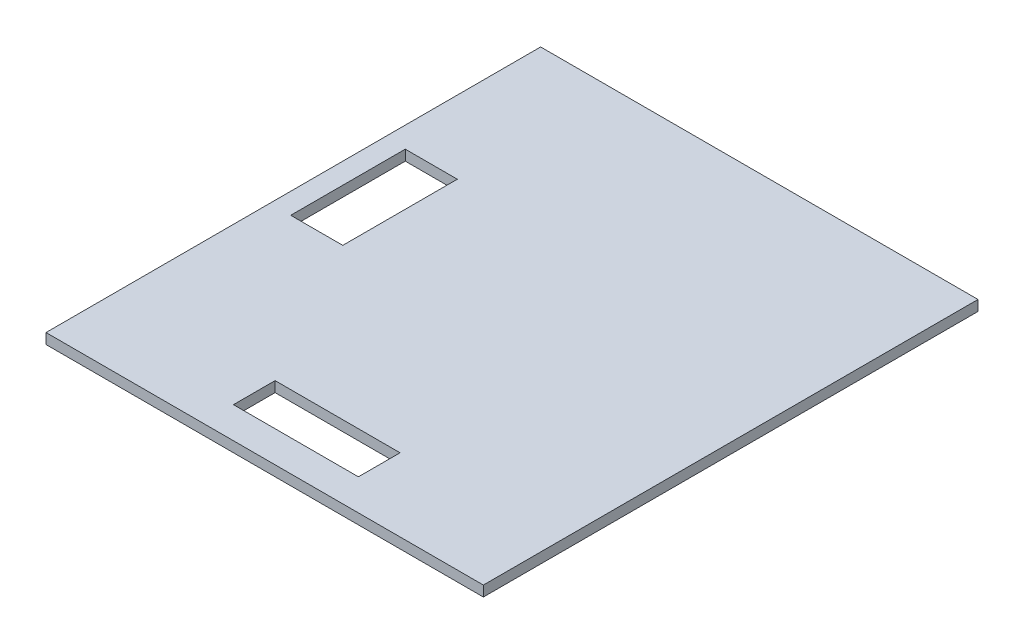
ISO-10303-21;
HEADER;
FILE_DESCRIPTION(('STEP AP214'),'2;1');
FILE_NAME('part.step','',(''),(''),'','','');
FILE_SCHEMA(('AUTOMOTIVE_DESIGN { 1 0 10303 214 1 1 1 1 }'));
ENDSEC;
DATA;
#1=APPLICATION_CONTEXT('core data for automotive mechanical design processes');
#2=APPLICATION_PROTOCOL_DEFINITION('international standard','automotive_design',2000,#1);
#3=PRODUCT_CONTEXT('',#1,'mechanical');
#4=PRODUCT('Part','Part','',(#3));
#5=PRODUCT_RELATED_PRODUCT_CATEGORY('part','',(#4));
#6=PRODUCT_DEFINITION_FORMATION('','',#4);
#7=PRODUCT_DEFINITION_CONTEXT('part definition',#1,'design');
#8=PRODUCT_DEFINITION('design','',#6,#7);
#9=PRODUCT_DEFINITION_SHAPE('','',#8);
#10=(LENGTH_UNIT() NAMED_UNIT(*) SI_UNIT(.MILLI.,.METRE.));
#11=(NAMED_UNIT(*) PLANE_ANGLE_UNIT() SI_UNIT($,.RADIAN.));
#12=(NAMED_UNIT(*) SI_UNIT($,.STERADIAN.) SOLID_ANGLE_UNIT());
#13=UNCERTAINTY_MEASURE_WITH_UNIT(LENGTH_MEASURE(1.E-05),#10,'distance_accuracy_value','');
#14=(GEOMETRIC_REPRESENTATION_CONTEXT(3) GLOBAL_UNCERTAINTY_ASSIGNED_CONTEXT((#13)) GLOBAL_UNIT_ASSIGNED_CONTEXT((#10,
#11,#12)) REPRESENTATION_CONTEXT('',''));
#15=CARTESIAN_POINT('',(0.,0.,0.));
#16=DIRECTION('',(0.,0.,1.));
#17=DIRECTION('',(1.,0.,0.));
#18=AXIS2_PLACEMENT_3D('',#15,#16,#17);
#19=CARTESIAN_POINT('',(0.,1.,0.));
#20=DIRECTION('',(0.,-1.,0.));
#21=DIRECTION('',(0.,0.,-1.));
#22=AXIS2_PLACEMENT_3D('',#19,#20,#21);
#23=PLANE('',#22);
#24=DIRECTION('',(0.,0.,1.));
#25=VECTOR('',#24,1.);
#26=CARTESIAN_POINT('',(-6.00000000000001,1.,0.));
#27=LINE('',#26,#25);
#28=CARTESIAN_POINT('',(-6.00000000000001,1.,16.75));
#29=VERTEX_POINT('',#28);
#30=CARTESIAN_POINT('',(-6.00000000000001,1.,20.75));
#31=VERTEX_POINT('',#30);
#32=EDGE_CURVE('E183',#29,#31,#27,.T.);
#33=ORIENTED_EDGE('',*,*,#32,.F.);
#34=DIRECTION('',(-1.,0.,0.));
#35=VECTOR('',#34,1.);
#36=CARTESIAN_POINT('',(0.,1.,16.75));
#37=LINE('',#36,#35);
#38=CARTESIAN_POINT('',(6.,1.,16.75));
#39=VERTEX_POINT('',#38);
#40=EDGE_CURVE('E135',#39,#29,#37,.T.);
#41=ORIENTED_EDGE('',*,*,#40,.F.);
#42=DIRECTION('',(0.,0.,-1.));
#43=VECTOR('',#42,1.);
#44=CARTESIAN_POINT('',(6.,1.,0.));
#45=LINE('',#44,#43);
#46=CARTESIAN_POINT('',(6.,1.,20.75));
#47=VERTEX_POINT('',#46);
#48=EDGE_CURVE('E179',#47,#39,#45,.T.);
#49=ORIENTED_EDGE('',*,*,#48,.F.);
#50=DIRECTION('',(1.,0.,0.));
#51=VECTOR('',#50,1.);
#52=CARTESIAN_POINT('',(0.,1.,20.75));
#53=LINE('',#52,#51);
#54=EDGE_CURVE('E181',#31,#47,#53,.T.);
#55=ORIENTED_EDGE('',*,*,#54,.F.);
#56=EDGE_LOOP('',(#33,#41,#49,#55));
#57=FACE_BOUND('',#56,.T.);
#58=DIRECTION('',(0.,0.,-1.));
#59=VECTOR('',#58,1.);
#60=CARTESIAN_POINT('',(21.,1.,23.75));
#61=LINE('',#60,#59);
#62=CARTESIAN_POINT('',(21.,1.,23.75));
#63=VERTEX_POINT('',#62);
#64=CARTESIAN_POINT('',(21.,1.,-23.75));
#65=VERTEX_POINT('',#64);
#66=EDGE_CURVE('E193',#63,#65,#61,.T.);
#67=ORIENTED_EDGE('',*,*,#66,.T.);
#68=DIRECTION('',(-1.,0.,0.));
#69=VECTOR('',#68,1.);
#70=CARTESIAN_POINT('',(-21.,1.,-23.75));
#71=LINE('',#70,#69);
#72=CARTESIAN_POINT('',(-21.,1.,-23.75));
#73=VERTEX_POINT('',#72);
#74=EDGE_CURVE('E196',#65,#73,#71,.T.);
#75=ORIENTED_EDGE('',*,*,#74,.T.);
#76=DIRECTION('',(0.,0.,1.));
#77=VECTOR('',#76,1.);
#78=CARTESIAN_POINT('',(-21.,1.,23.75));
#79=LINE('',#78,#77);
#80=CARTESIAN_POINT('',(-21.,1.,23.75));
#81=VERTEX_POINT('',#80);
#82=EDGE_CURVE('E199',#73,#81,#79,.T.);
#83=ORIENTED_EDGE('',*,*,#82,.T.);
#84=DIRECTION('',(1.,0.,0.));
#85=VECTOR('',#84,1.);
#86=CARTESIAN_POINT('',(-21.,1.,23.75));
#87=LINE('',#86,#85);
#88=EDGE_CURVE('E201',#81,#63,#87,.T.);
#89=ORIENTED_EDGE('',*,*,#88,.T.);
#90=EDGE_LOOP('',(#67,#75,#83,#89));
#91=FACE_BOUND('',#90,.T.);
#92=DIRECTION('',(0.,0.,1.));
#93=VECTOR('',#92,1.);
#94=CARTESIAN_POINT('',(-19.,1.,0.));
#95=LINE('',#94,#93);
#96=CARTESIAN_POINT('',(-19.,1.,-8.75));
#97=VERTEX_POINT('',#96);
#98=CARTESIAN_POINT('',(-19.,1.,2.25));
#99=VERTEX_POINT('',#98);
#100=EDGE_CURVE('E132',#97,#99,#95,.T.);
#101=ORIENTED_EDGE('',*,*,#100,.F.);
#102=DIRECTION('',(-1.,0.,0.));
#103=VECTOR('',#102,1.);
#104=CARTESIAN_POINT('',(0.,1.,-8.75));
#105=LINE('',#104,#103);
#106=CARTESIAN_POINT('',(-14.,1.,-8.75));
#107=VERTEX_POINT('',#106);
#108=EDGE_CURVE('E185',#107,#97,#105,.T.);
#109=ORIENTED_EDGE('',*,*,#108,.F.);
#110=DIRECTION('',(0.,0.,-1.));
#111=VECTOR('',#110,1.);
#112=CARTESIAN_POINT('',(-14.,1.,0.));
#113=LINE('',#112,#111);
#114=CARTESIAN_POINT('',(-14.,1.,2.25));
#115=VERTEX_POINT('',#114);
#116=EDGE_CURVE('E187',#115,#107,#113,.T.);
#117=ORIENTED_EDGE('',*,*,#116,.F.);
#118=DIRECTION('',(1.,0.,0.));
#119=VECTOR('',#118,1.);
#120=CARTESIAN_POINT('',(0.,1.,2.25));
#121=LINE('',#120,#119);
#122=EDGE_CURVE('E189',#99,#115,#121,.T.);
#123=ORIENTED_EDGE('',*,*,#122,.F.);
#124=EDGE_LOOP('',(#101,#109,#117,#123));
#125=FACE_BOUND('',#124,.T.);
#126=ADVANCED_FACE('F36',(#57,#91,#125),#23,.F.);
#127=CARTESIAN_POINT('',(0.,0.,0.));
#128=DIRECTION('',(0.,-1.,0.));
#129=DIRECTION('',(0.,0.,-1.));
#130=AXIS2_PLACEMENT_3D('',#127,#128,#129);
#131=PLANE('',#130);
#132=DIRECTION('',(0.,0.,-1.));
#133=VECTOR('',#132,1.);
#134=CARTESIAN_POINT('',(21.,0.,23.75));
#135=LINE('',#134,#133);
#136=CARTESIAN_POINT('',(21.,0.,23.75));
#137=VERTEX_POINT('',#136);
#138=CARTESIAN_POINT('',(21.,0.,-23.75));
#139=VERTEX_POINT('',#138);
#140=EDGE_CURVE('E192',#137,#139,#135,.T.);
#141=ORIENTED_EDGE('',*,*,#140,.F.);
#142=DIRECTION('',(1.,0.,0.));
#143=VECTOR('',#142,1.);
#144=CARTESIAN_POINT('',(-21.,0.,23.75));
#145=LINE('',#144,#143);
#146=CARTESIAN_POINT('',(-21.,0.,23.75));
#147=VERTEX_POINT('',#146);
#148=EDGE_CURVE('E197',#147,#137,#145,.T.);
#149=ORIENTED_EDGE('',*,*,#148,.F.);
#150=DIRECTION('',(0.,0.,1.));
#151=VECTOR('',#150,1.);
#152=CARTESIAN_POINT('',(-21.,0.,23.75));
#153=LINE('',#152,#151);
#154=CARTESIAN_POINT('',(-21.,0.,-23.75));
#155=VERTEX_POINT('',#154);
#156=EDGE_CURVE('E208',#155,#147,#153,.T.);
#157=ORIENTED_EDGE('',*,*,#156,.F.);
#158=DIRECTION('',(-1.,0.,0.));
#159=VECTOR('',#158,1.);
#160=CARTESIAN_POINT('',(-21.,0.,-23.75));
#161=LINE('',#160,#159);
#162=EDGE_CURVE('E206',#139,#155,#161,.T.);
#163=ORIENTED_EDGE('',*,*,#162,.F.);
#164=EDGE_LOOP('',(#141,#149,#157,#163));
#165=FACE_BOUND('',#164,.T.);
#166=DIRECTION('',(-1.,0.,0.));
#167=VECTOR('',#166,1.);
#168=CARTESIAN_POINT('',(-6.00000000000001,0.,16.75));
#169=LINE('',#168,#167);
#170=CARTESIAN_POINT('',(6.,0.,16.75));
#171=VERTEX_POINT('',#170);
#172=CARTESIAN_POINT('',(-6.00000000000001,0.,16.75));
#173=VERTEX_POINT('',#172);
#174=EDGE_CURVE('E170',#171,#173,#169,.T.);
#175=ORIENTED_EDGE('',*,*,#174,.T.);
#176=DIRECTION('',(0.,0.,1.));
#177=VECTOR('',#176,1.);
#178=CARTESIAN_POINT('',(-6.00000000000001,0.,20.75));
#179=LINE('',#178,#177);
#180=CARTESIAN_POINT('',(-6.00000000000001,0.,20.75));
#181=VERTEX_POINT('',#180);
#182=EDGE_CURVE('E161',#173,#181,#179,.T.);
#183=ORIENTED_EDGE('',*,*,#182,.T.);
#184=DIRECTION('',(1.,0.,0.));
#185=VECTOR('',#184,1.);
#186=CARTESIAN_POINT('',(-6.00000000000001,0.,20.75));
#187=LINE('',#186,#185);
#188=CARTESIAN_POINT('',(6.,0.,20.75));
#189=VERTEX_POINT('',#188);
#190=EDGE_CURVE('E164',#181,#189,#187,.T.);
#191=ORIENTED_EDGE('',*,*,#190,.T.);
#192=DIRECTION('',(0.,0.,-1.));
#193=VECTOR('',#192,1.);
#194=CARTESIAN_POINT('',(6.,0.,20.75));
#195=LINE('',#194,#193);
#196=EDGE_CURVE('E167',#189,#171,#195,.T.);
#197=ORIENTED_EDGE('',*,*,#196,.T.);
#198=EDGE_LOOP('',(#175,#183,#191,#197));
#199=FACE_BOUND('',#198,.T.);
#200=DIRECTION('',(-1.,0.,0.));
#201=VECTOR('',#200,1.);
#202=CARTESIAN_POINT('',(-19.,0.,-8.75));
#203=LINE('',#202,#201);
#204=CARTESIAN_POINT('',(-14.,0.,-8.75));
#205=VERTEX_POINT('',#204);
#206=CARTESIAN_POINT('',(-19.,0.,-8.75));
#207=VERTEX_POINT('',#206);
#208=EDGE_CURVE('E149',#205,#207,#203,.T.);
#209=ORIENTED_EDGE('',*,*,#208,.T.);
#210=DIRECTION('',(0.,0.,1.));
#211=VECTOR('',#210,1.);
#212=CARTESIAN_POINT('',(-19.,0.,2.25));
#213=LINE('',#212,#211);
#214=CARTESIAN_POINT('',(-19.,0.,2.25));
#215=VERTEX_POINT('',#214);
#216=EDGE_CURVE('E129',#207,#215,#213,.T.);
#217=ORIENTED_EDGE('',*,*,#216,.T.);
#218=DIRECTION('',(1.,0.,0.));
#219=VECTOR('',#218,1.);
#220=CARTESIAN_POINT('',(-19.,0.,2.25));
#221=LINE('',#220,#219);
#222=CARTESIAN_POINT('',(-14.,0.,2.25));
#223=VERTEX_POINT('',#222);
#224=EDGE_CURVE('E139',#215,#223,#221,.T.);
#225=ORIENTED_EDGE('',*,*,#224,.T.);
#226=DIRECTION('',(0.,0.,-1.));
#227=VECTOR('',#226,1.);
#228=CARTESIAN_POINT('',(-14.,0.,2.25));
#229=LINE('',#228,#227);
#230=EDGE_CURVE('E145',#223,#205,#229,.T.);
#231=ORIENTED_EDGE('',*,*,#230,.T.);
#232=EDGE_LOOP('',(#209,#217,#225,#231));
#233=FACE_BOUND('',#232,.T.);
#234=ADVANCED_FACE('F148',(#165,#199,#233),#131,.T.);
#235=CARTESIAN_POINT('',(21.,1.,23.75));
#236=DIRECTION('',(-1.,0.,0.));
#237=DIRECTION('',(0.,0.,1.));
#238=AXIS2_PLACEMENT_3D('',#235,#236,#237);
#239=PLANE('',#238);
#240=ORIENTED_EDGE('',*,*,#140,.T.);
#241=DIRECTION('',(0.,-1.,0.));
#242=VECTOR('',#241,1.);
#243=CARTESIAN_POINT('',(21.,1.,-23.75));
#244=LINE('',#243,#242);
#245=EDGE_CURVE('E11',#65,#139,#244,.T.);
#246=ORIENTED_EDGE('',*,*,#245,.F.);
#247=ORIENTED_EDGE('',*,*,#66,.F.);
#248=DIRECTION('',(0.,-1.,0.));
#249=VECTOR('',#248,1.);
#250=CARTESIAN_POINT('',(21.,1.,23.75));
#251=LINE('',#250,#249);
#252=EDGE_CURVE('E203',#63,#137,#251,.T.);
#253=ORIENTED_EDGE('',*,*,#252,.T.);
#254=EDGE_LOOP('',(#240,#246,#247,#253));
#255=FACE_BOUND('',#254,.T.);
#256=ADVANCED_FACE('F38',(#255),#239,.F.);
#257=CARTESIAN_POINT('',(-21.,1.,-23.75));
#258=DIRECTION('',(0.,0.,1.));
#259=DIRECTION('',(1.,0.,0.));
#260=AXIS2_PLACEMENT_3D('',#257,#258,#259);
#261=PLANE('',#260);
#262=ORIENTED_EDGE('',*,*,#162,.T.);
#263=DIRECTION('',(0.,-1.,0.));
#264=VECTOR('',#263,1.);
#265=CARTESIAN_POINT('',(-21.,1.,-23.75));
#266=LINE('',#265,#264);
#267=EDGE_CURVE('E44',#73,#155,#266,.T.);
#268=ORIENTED_EDGE('',*,*,#267,.F.);
#269=ORIENTED_EDGE('',*,*,#74,.F.);
#270=ORIENTED_EDGE('',*,*,#245,.T.);
#271=EDGE_LOOP('',(#262,#268,#269,#270));
#272=FACE_BOUND('',#271,.T.);
#273=ADVANCED_FACE('F236',(#272),#261,.F.);
#274=CARTESIAN_POINT('',(-21.,1.,23.75));
#275=DIRECTION('',(1.,0.,0.));
#276=DIRECTION('',(0.,0.,-1.));
#277=AXIS2_PLACEMENT_3D('',#274,#275,#276);
#278=PLANE('',#277);
#279=ORIENTED_EDGE('',*,*,#156,.T.);
#280=DIRECTION('',(0.,-1.,0.));
#281=VECTOR('',#280,1.);
#282=CARTESIAN_POINT('',(-21.,1.,23.75));
#283=LINE('',#282,#281);
#284=EDGE_CURVE('E213',#81,#147,#283,.T.);
#285=ORIENTED_EDGE('',*,*,#284,.F.);
#286=ORIENTED_EDGE('',*,*,#82,.F.);
#287=ORIENTED_EDGE('',*,*,#267,.T.);
#288=EDGE_LOOP('',(#279,#285,#286,#287));
#289=FACE_BOUND('',#288,.T.);
#290=ADVANCED_FACE('F220',(#289),#278,.F.);
#291=CARTESIAN_POINT('',(-21.,1.,23.75));
#292=DIRECTION('',(0.,0.,-1.));
#293=DIRECTION('',(-1.,0.,0.));
#294=AXIS2_PLACEMENT_3D('',#291,#292,#293);
#295=PLANE('',#294);
#296=ORIENTED_EDGE('',*,*,#148,.T.);
#297=ORIENTED_EDGE('',*,*,#252,.F.);
#298=ORIENTED_EDGE('',*,*,#88,.F.);
#299=ORIENTED_EDGE('',*,*,#284,.T.);
#300=EDGE_LOOP('',(#296,#297,#298,#299));
#301=FACE_BOUND('',#300,.T.);
#302=ADVANCED_FACE('F229',(#301),#295,.F.);
#303=CARTESIAN_POINT('',(-6.00000000000001,5.,20.75));
#304=DIRECTION('',(1.,0.,0.));
#305=DIRECTION('',(0.,0.,-1.));
#306=AXIS2_PLACEMENT_3D('',#303,#304,#305);
#307=PLANE('',#306);
#308=ORIENTED_EDGE('',*,*,#32,.T.);
#309=DIRECTION('',(0.,-1.,0.));
#310=VECTOR('',#309,1.);
#311=CARTESIAN_POINT('',(-6.00000000000001,5.,20.75));
#312=LINE('',#311,#310);
#313=EDGE_CURVE('E150',#31,#181,#312,.T.);
#314=ORIENTED_EDGE('',*,*,#313,.T.);
#315=ORIENTED_EDGE('',*,*,#182,.F.);
#316=DIRECTION('',(0.,-1.,0.));
#317=VECTOR('',#316,1.);
#318=CARTESIAN_POINT('',(-6.00000000000001,5.,16.75));
#319=LINE('',#318,#317);
#320=EDGE_CURVE('E173',#29,#173,#319,.T.);
#321=ORIENTED_EDGE('',*,*,#320,.F.);
#322=EDGE_LOOP('',(#308,#314,#315,#321));
#323=FACE_BOUND('',#322,.T.);
#324=ADVANCED_FACE('F252',(#323),#307,.T.);
#325=CARTESIAN_POINT('',(-6.00000000000001,5.,20.75));
#326=DIRECTION('',(0.,0.,-1.));
#327=DIRECTION('',(-1.,0.,0.));
#328=AXIS2_PLACEMENT_3D('',#325,#326,#327);
#329=PLANE('',#328);
#330=ORIENTED_EDGE('',*,*,#54,.T.);
#331=DIRECTION('',(0.,-1.,0.));
#332=VECTOR('',#331,1.);
#333=CARTESIAN_POINT('',(6.,5.,20.75));
#334=LINE('',#333,#332);
#335=EDGE_CURVE('E152',#47,#189,#334,.T.);
#336=ORIENTED_EDGE('',*,*,#335,.T.);
#337=ORIENTED_EDGE('',*,*,#190,.F.);
#338=ORIENTED_EDGE('',*,*,#313,.F.);
#339=EDGE_LOOP('',(#330,#336,#337,#338));
#340=FACE_BOUND('',#339,.T.);
#341=ADVANCED_FACE('F259',(#340),#329,.T.);
#342=CARTESIAN_POINT('',(6.,5.,20.75));
#343=DIRECTION('',(-1.,0.,0.));
#344=DIRECTION('',(0.,0.,1.));
#345=AXIS2_PLACEMENT_3D('',#342,#343,#344);
#346=PLANE('',#345);
#347=ORIENTED_EDGE('',*,*,#48,.T.);
#348=DIRECTION('',(0.,-1.,0.));
#349=VECTOR('',#348,1.);
#350=CARTESIAN_POINT('',(6.,5.,16.75));
#351=LINE('',#350,#349);
#352=EDGE_CURVE('E59',#39,#171,#351,.T.);
#353=ORIENTED_EDGE('',*,*,#352,.T.);
#354=ORIENTED_EDGE('',*,*,#196,.F.);
#355=ORIENTED_EDGE('',*,*,#335,.F.);
#356=EDGE_LOOP('',(#347,#353,#354,#355));
#357=FACE_BOUND('',#356,.T.);
#358=ADVANCED_FACE('F264',(#357),#346,.T.);
#359=CARTESIAN_POINT('',(-6.00000000000001,5.,16.75));
#360=DIRECTION('',(0.,0.,1.));
#361=DIRECTION('',(1.,0.,0.));
#362=AXIS2_PLACEMENT_3D('',#359,#360,#361);
#363=PLANE('',#362);
#364=ORIENTED_EDGE('',*,*,#40,.T.);
#365=ORIENTED_EDGE('',*,*,#320,.T.);
#366=ORIENTED_EDGE('',*,*,#174,.F.);
#367=ORIENTED_EDGE('',*,*,#352,.F.);
#368=EDGE_LOOP('',(#364,#365,#366,#367));
#369=FACE_BOUND('',#368,.T.);
#370=ADVANCED_FACE('F275',(#369),#363,.T.);
#371=CARTESIAN_POINT('',(-19.,5.,2.25));
#372=DIRECTION('',(1.,0.,0.));
#373=DIRECTION('',(0.,0.,-1.));
#374=AXIS2_PLACEMENT_3D('',#371,#372,#373);
#375=PLANE('',#374);
#376=ORIENTED_EDGE('',*,*,#100,.T.);
#377=DIRECTION('',(0.,-1.,0.));
#378=VECTOR('',#377,1.);
#379=CARTESIAN_POINT('',(-19.,5.,2.25));
#380=LINE('',#379,#378);
#381=EDGE_CURVE('E124',#99,#215,#380,.T.);
#382=ORIENTED_EDGE('',*,*,#381,.T.);
#383=ORIENTED_EDGE('',*,*,#216,.F.);
#384=DIRECTION('',(0.,-1.,0.));
#385=VECTOR('',#384,1.);
#386=CARTESIAN_POINT('',(-19.,5.,-8.75));
#387=LINE('',#386,#385);
#388=EDGE_CURVE('E157',#97,#207,#387,.T.);
#389=ORIENTED_EDGE('',*,*,#388,.F.);
#390=EDGE_LOOP('',(#376,#382,#383,#389));
#391=FACE_BOUND('',#390,.T.);
#392=ADVANCED_FACE('F126',(#391),#375,.T.);
#393=CARTESIAN_POINT('',(-19.,5.,2.25));
#394=DIRECTION('',(0.,0.,-1.));
#395=DIRECTION('',(-1.,0.,0.));
#396=AXIS2_PLACEMENT_3D('',#393,#394,#395);
#397=PLANE('',#396);
#398=ORIENTED_EDGE('',*,*,#122,.T.);
#399=DIRECTION('',(0.,-1.,0.));
#400=VECTOR('',#399,1.);
#401=CARTESIAN_POINT('',(-14.,5.,2.25));
#402=LINE('',#401,#400);
#403=EDGE_CURVE('E136',#115,#223,#402,.T.);
#404=ORIENTED_EDGE('',*,*,#403,.T.);
#405=ORIENTED_EDGE('',*,*,#224,.F.);
#406=ORIENTED_EDGE('',*,*,#381,.F.);
#407=EDGE_LOOP('',(#398,#404,#405,#406));
#408=FACE_BOUND('',#407,.T.);
#409=ADVANCED_FACE('F140',(#408),#397,.T.);
#410=CARTESIAN_POINT('',(-14.,5.,2.25));
#411=DIRECTION('',(-1.,0.,0.));
#412=DIRECTION('',(0.,0.,1.));
#413=AXIS2_PLACEMENT_3D('',#410,#411,#412);
#414=PLANE('',#413);
#415=ORIENTED_EDGE('',*,*,#116,.T.);
#416=DIRECTION('',(0.,-1.,0.));
#417=VECTOR('',#416,1.);
#418=CARTESIAN_POINT('',(-14.,5.,-8.75));
#419=LINE('',#418,#417);
#420=EDGE_CURVE('E51',#107,#205,#419,.T.);
#421=ORIENTED_EDGE('',*,*,#420,.T.);
#422=ORIENTED_EDGE('',*,*,#230,.F.);
#423=ORIENTED_EDGE('',*,*,#403,.F.);
#424=EDGE_LOOP('',(#415,#421,#422,#423));
#425=FACE_BOUND('',#424,.T.);
#426=ADVANCED_FACE('F287',(#425),#414,.T.);
#427=CARTESIAN_POINT('',(-19.,5.,-8.75));
#428=DIRECTION('',(0.,0.,1.));
#429=DIRECTION('',(1.,0.,0.));
#430=AXIS2_PLACEMENT_3D('',#427,#428,#429);
#431=PLANE('',#430);
#432=ORIENTED_EDGE('',*,*,#108,.T.);
#433=ORIENTED_EDGE('',*,*,#388,.T.);
#434=ORIENTED_EDGE('',*,*,#208,.F.);
#435=ORIENTED_EDGE('',*,*,#420,.F.);
#436=EDGE_LOOP('',(#432,#433,#434,#435));
#437=FACE_BOUND('',#436,.T.);
#438=ADVANCED_FACE('F290',(#437),#431,.T.);
#439=CLOSED_SHELL('',(#126,#234,#256,#273,#290,#302,#324,#341,#358,#370,#392,#409,#426,#438));
#440=MANIFOLD_SOLID_BREP('B2',#439);
#441=ADVANCED_BREP_SHAPE_REPRESENTATION('',(#18,#440),#14);
#442=SHAPE_DEFINITION_REPRESENTATION(#9,#441);
ENDSEC;
END-ISO-10303-21;
